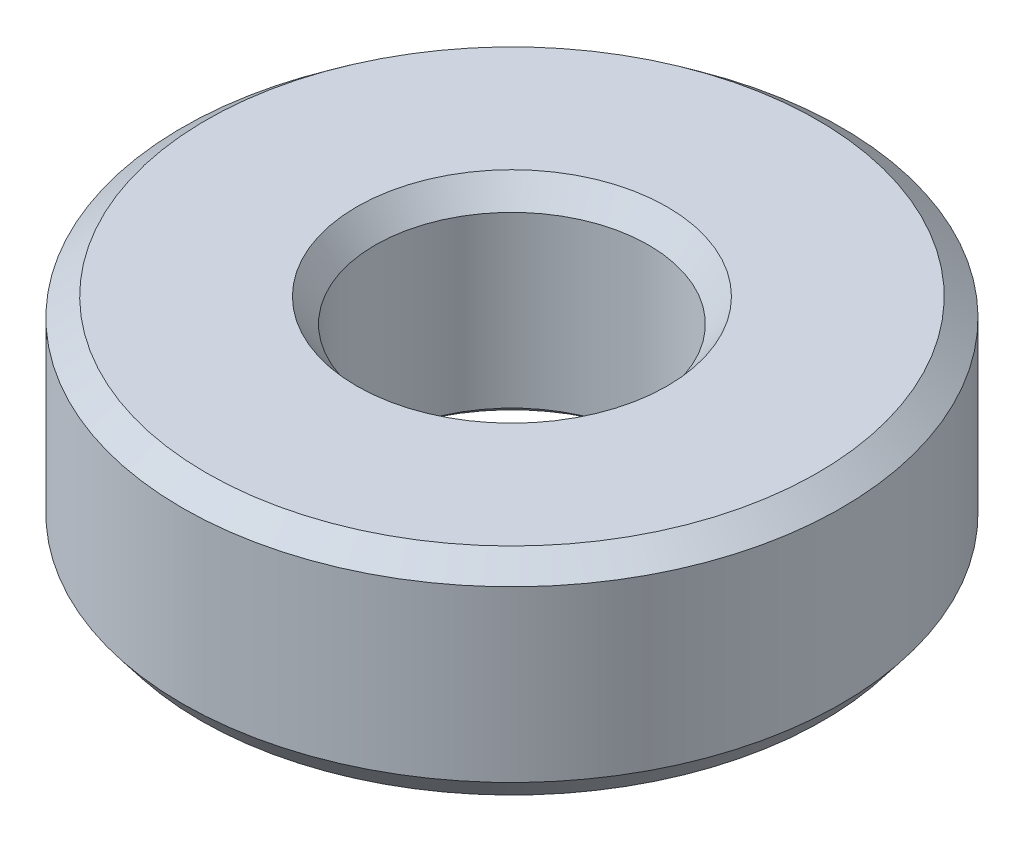
ISO-10303-21;
HEADER;
FILE_DESCRIPTION(('STEP AP214'),'2;1');
FILE_NAME('part.step','',(''),(''),'','','');
FILE_SCHEMA(('AUTOMOTIVE_DESIGN { 1 0 10303 214 1 1 1 1 }'));
ENDSEC;
DATA;
#1=APPLICATION_CONTEXT('core data for automotive mechanical design processes');
#2=APPLICATION_PROTOCOL_DEFINITION('international standard','automotive_design',2000,#1);
#3=PRODUCT_CONTEXT('',#1,'mechanical');
#4=PRODUCT('Part','Part','',(#3));
#5=PRODUCT_RELATED_PRODUCT_CATEGORY('part','',(#4));
#6=PRODUCT_DEFINITION_FORMATION('','',#4);
#7=PRODUCT_DEFINITION_CONTEXT('part definition',#1,'design');
#8=PRODUCT_DEFINITION('design','',#6,#7);
#9=PRODUCT_DEFINITION_SHAPE('','',#8);
#10=(LENGTH_UNIT() NAMED_UNIT(*) SI_UNIT(.MILLI.,.METRE.));
#11=(NAMED_UNIT(*) PLANE_ANGLE_UNIT() SI_UNIT($,.RADIAN.));
#12=(NAMED_UNIT(*) SI_UNIT($,.STERADIAN.) SOLID_ANGLE_UNIT());
#13=UNCERTAINTY_MEASURE_WITH_UNIT(LENGTH_MEASURE(1.E-05),#10,'distance_accuracy_value','');
#14=(GEOMETRIC_REPRESENTATION_CONTEXT(3) GLOBAL_UNCERTAINTY_ASSIGNED_CONTEXT((#13)) GLOBAL_UNIT_ASSIGNED_CONTEXT((#10,
#11,#12)) REPRESENTATION_CONTEXT('',''));
#15=CARTESIAN_POINT('',(0.,0.,0.));
#16=DIRECTION('',(0.,0.,1.));
#17=DIRECTION('',(1.,0.,0.));
#18=AXIS2_PLACEMENT_3D('',#15,#16,#17);
#19=CARTESIAN_POINT('',(0.,11.2479104798563,0.));
#20=DIRECTION('',(0.,-1.,0.));
#21=DIRECTION('',(0.,0.,-1.));
#22=AXIS2_PLACEMENT_3D('',#19,#20,#21);
#23=CYLINDRICAL_SURFACE('',#22,17.5);
#24=CARTESIAN_POINT('',(0.,1.26951103327143,0.));
#25=DIRECTION('',(0.,1.,0.));
#26=DIRECTION('',(0.,0.,1.));
#27=AXIS2_PLACEMENT_3D('',#24,#25,#26);
#28=CIRCLE('',#27,17.5);
#29=CARTESIAN_POINT('',(0.,1.26951103327143,17.5));
#30=VERTEX_POINT('',#29);
#31=EDGE_CURVE('E10',#30,#30,#28,.T.);
#32=ORIENTED_EDGE('',*,*,#31,.T.);
#33=EDGE_LOOP('',(#32));
#34=FACE_BOUND('',#33,.T.);
#35=CARTESIAN_POINT('',(0.,10.2694014068149,0.));
#36=DIRECTION('',(0.,1.,0.));
#37=DIRECTION('',(0.,0.,1.));
#38=AXIS2_PLACEMENT_3D('',#35,#36,#37);
#39=CIRCLE('',#38,17.5);
#40=CARTESIAN_POINT('',(0.,10.2694014068149,17.5));
#41=VERTEX_POINT('',#40);
#42=EDGE_CURVE('E50',#41,#41,#39,.F.);
#43=ORIENTED_EDGE('',*,*,#42,.T.);
#44=EDGE_LOOP('',(#43));
#45=FACE_BOUND('',#44,.T.);
#46=ADVANCED_FACE('F39',(#34,#45),#23,.T.);
#47=CARTESIAN_POINT('',(0.,11.2479104798563,0.));
#48=DIRECTION('',(0.,1.,0.));
#49=DIRECTION('',(0.,0.,1.));
#50=AXIS2_PLACEMENT_3D('',#47,#48,#49);
#51=PLANE('',#50);
#52=CARTESIAN_POINT('',(0.,11.2479104798563,0.));
#53=DIRECTION('',(0.,1.,0.));
#54=DIRECTION('',(0.,0.,1.));
#55=AXIS2_PLACEMENT_3D('',#52,#53,#54);
#56=CIRCLE('',#55,8.24314675239942);
#57=CARTESIAN_POINT('',(0.,11.2479104798563,8.24314675239942));
#58=VERTEX_POINT('',#57);
#59=EDGE_CURVE('E58',#58,#58,#56,.F.);
#60=ORIENTED_EDGE('',*,*,#59,.T.);
#61=EDGE_LOOP('',(#60));
#62=FACE_BOUND('',#61,.T.);
#63=CARTESIAN_POINT('',(0.,11.2479104798563,0.));
#64=DIRECTION('',(0.,1.,0.));
#65=DIRECTION('',(0.,0.,1.));
#66=AXIS2_PLACEMENT_3D('',#63,#64,#65);
#67=CIRCLE('',#66,16.2304889667286);
#68=CARTESIAN_POINT('',(0.,11.2479104798563,16.2304889667286));
#69=VERTEX_POINT('',#68);
#70=EDGE_CURVE('E61',#69,#69,#67,.T.);
#71=ORIENTED_EDGE('',*,*,#70,.T.);
#72=EDGE_LOOP('',(#71));
#73=FACE_BOUND('',#72,.T.);
#74=ADVANCED_FACE('F88',(#62,#73),#51,.T.);
#75=CARTESIAN_POINT('',(0.,0.,0.));
#76=DIRECTION('',(0.,1.,0.));
#77=DIRECTION('',(0.,0.,1.));
#78=AXIS2_PLACEMENT_3D('',#75,#76,#77);
#79=PLANE('',#78);
#80=CARTESIAN_POINT('',(0.,0.,0.));
#81=DIRECTION('',(0.,1.,0.));
#82=DIRECTION('',(0.,0.,1.));
#83=AXIS2_PLACEMENT_3D('',#80,#81,#82);
#84=CIRCLE('',#83,8.53414871262945);
#85=CARTESIAN_POINT('',(0.,0.,8.53414871262945));
#86=VERTEX_POINT('',#85);
#87=EDGE_CURVE('E51',#86,#86,#84,.T.);
#88=ORIENTED_EDGE('',*,*,#87,.T.);
#89=EDGE_LOOP('',(#88));
#90=FACE_BOUND('',#89,.T.);
#91=CARTESIAN_POINT('',(0.,0.,0.));
#92=DIRECTION('',(0.,1.,0.));
#93=DIRECTION('',(0.,0.,1.));
#94=AXIS2_PLACEMENT_3D('',#91,#92,#93);
#95=CIRCLE('',#94,16.5214909269586);
#96=CARTESIAN_POINT('',(0.,0.,16.5214909269586));
#97=VERTEX_POINT('',#96);
#98=EDGE_CURVE('E54',#97,#97,#95,.F.);
#99=ORIENTED_EDGE('',*,*,#98,.T.);
#100=EDGE_LOOP('',(#99));
#101=FACE_BOUND('',#100,.T.);
#102=ADVANCED_FACE('F83',(#90,#101),#79,.F.);
#103=CARTESIAN_POINT('',(0.,11.2479104798563,0.));
#104=DIRECTION('',(0.,-1.,0.));
#105=DIRECTION('',(0.,0.,-1.));
#106=AXIS2_PLACEMENT_3D('',#103,#104,#105);
#107=CYLINDRICAL_SURFACE('',#106,7.26463767935802);
#108=CARTESIAN_POINT('',(0.,9.97839944658487,0.));
#109=DIRECTION('',(0.,1.,0.));
#110=DIRECTION('',(0.,0.,1.));
#111=AXIS2_PLACEMENT_3D('',#108,#109,#110);
#112=CIRCLE('',#111,7.26463767935802);
#113=CARTESIAN_POINT('',(0.,9.97839944658487,7.26463767935802));
#114=VERTEX_POINT('',#113);
#115=EDGE_CURVE('E67',#114,#114,#112,.T.);
#116=ORIENTED_EDGE('',*,*,#115,.T.);
#117=EDGE_LOOP('',(#116));
#118=FACE_BOUND('',#117,.T.);
#119=CARTESIAN_POINT('',(0.,0.97850907304139,0.));
#120=DIRECTION('',(0.,1.,0.));
#121=DIRECTION('',(0.,0.,1.));
#122=AXIS2_PLACEMENT_3D('',#119,#120,#121);
#123=CIRCLE('',#122,7.26463767935802);
#124=CARTESIAN_POINT('',(0.,0.97850907304139,7.26463767935802));
#125=VERTEX_POINT('',#124);
#126=EDGE_CURVE('E69',#125,#125,#123,.F.);
#127=ORIENTED_EDGE('',*,*,#126,.T.);
#128=EDGE_LOOP('',(#127));
#129=FACE_BOUND('',#128,.T.);
#130=ADVANCED_FACE('F71',(#118,#129),#107,.F.);
#131=CARTESIAN_POINT('',(0.,9.97839944658487,0.));
#132=DIRECTION('',(0.,1.,0.));
#133=DIRECTION('',(0.,0.,1.));
#134=AXIS2_PLACEMENT_3D('',#131,#132,#133);
#135=CONICAL_SURFACE('',#134,7.26463767935802,0.656665912930157);
#136=ORIENTED_EDGE('',*,*,#59,.F.);
#137=EDGE_LOOP('',(#136));
#138=FACE_BOUND('',#137,.T.);
#139=ORIENTED_EDGE('',*,*,#115,.F.);
#140=EDGE_LOOP('',(#139));
#141=FACE_BOUND('',#140,.T.);
#142=ADVANCED_FACE('F77',(#138,#141),#135,.F.);
#143=CARTESIAN_POINT('',(0.,0.,0.));
#144=DIRECTION('',(0.,-1.,0.));
#145=DIRECTION('',(0.,0.,-1.));
#146=AXIS2_PLACEMENT_3D('',#143,#144,#145);
#147=CONICAL_SURFACE('',#146,8.53414871262945,0.91413041386474);
#148=ORIENTED_EDGE('',*,*,#126,.F.);
#149=EDGE_LOOP('',(#148));
#150=FACE_BOUND('',#149,.T.);
#151=ORIENTED_EDGE('',*,*,#87,.F.);
#152=EDGE_LOOP('',(#151));
#153=FACE_BOUND('',#152,.T.);
#154=ADVANCED_FACE('F73',(#150,#153),#147,.F.);
#155=CARTESIAN_POINT('',(0.,1.26951103327143,0.));
#156=DIRECTION('',(0.,1.,0.));
#157=DIRECTION('',(0.,0.,1.));
#158=AXIS2_PLACEMENT_3D('',#155,#156,#157);
#159=CONICAL_SURFACE('',#158,17.5,0.656665912930157);
#160=ORIENTED_EDGE('',*,*,#98,.F.);
#161=EDGE_LOOP('',(#160));
#162=FACE_BOUND('',#161,.T.);
#163=ORIENTED_EDGE('',*,*,#31,.F.);
#164=EDGE_LOOP('',(#163));
#165=FACE_BOUND('',#164,.T.);
#166=ADVANCED_FACE('F76',(#162,#165),#159,.T.);
#167=CARTESIAN_POINT('',(0.,11.2479104798563,0.));
#168=DIRECTION('',(0.,-1.,0.));
#169=DIRECTION('',(0.,0.,-1.));
#170=AXIS2_PLACEMENT_3D('',#167,#168,#169);
#171=CONICAL_SURFACE('',#170,16.2304889667286,0.914130413864741);
#172=ORIENTED_EDGE('',*,*,#42,.F.);
#173=EDGE_LOOP('',(#172));
#174=FACE_BOUND('',#173,.T.);
#175=ORIENTED_EDGE('',*,*,#70,.F.);
#176=EDGE_LOOP('',(#175));
#177=FACE_BOUND('',#176,.T.);
#178=ADVANCED_FACE('F45',(#174,#177),#171,.T.);
#179=CLOSED_SHELL('',(#46,#74,#102,#130,#142,#154,#166,#178));
#180=MANIFOLD_SOLID_BREP('B2',#179);
#181=ADVANCED_BREP_SHAPE_REPRESENTATION('',(#18,#180),#14);
#182=SHAPE_DEFINITION_REPRESENTATION(#9,#181);
ENDSEC;
END-ISO-10303-21;
